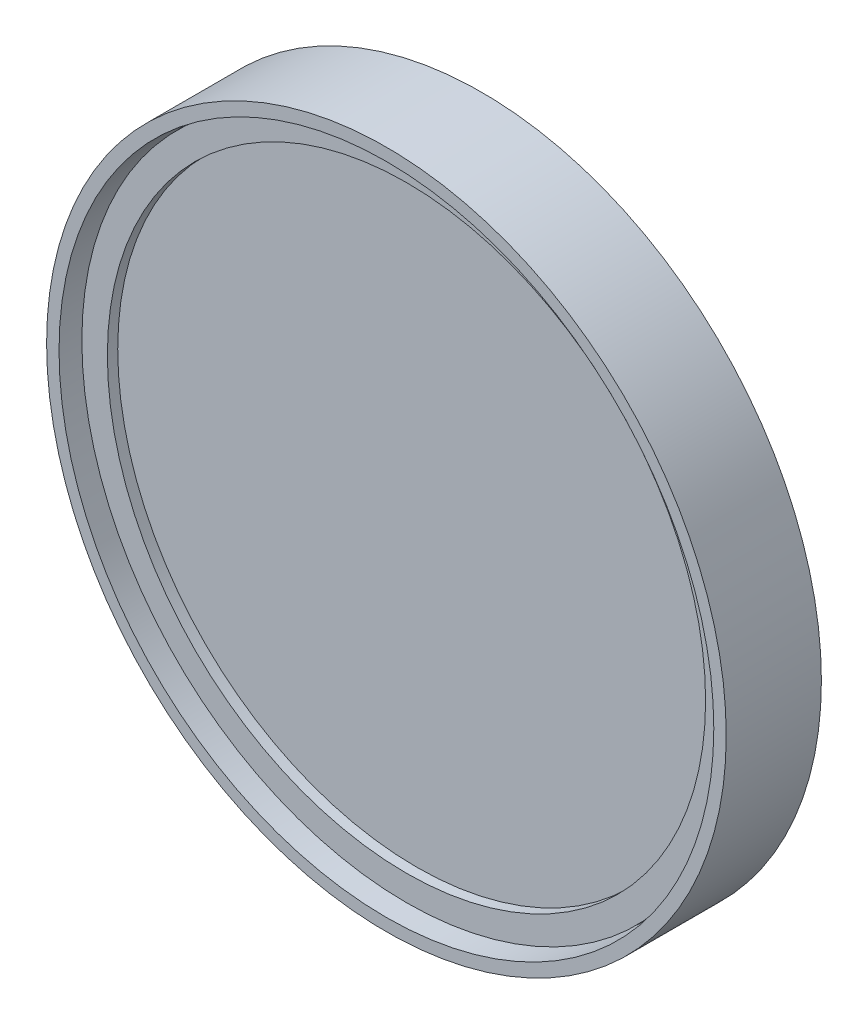
ISO-10303-21;
HEADER;
FILE_DESCRIPTION(('STEP AP214'),'2;1');
FILE_NAME('part.step','',(''),(''),'','','');
FILE_SCHEMA(('AUTOMOTIVE_DESIGN { 1 0 10303 214 1 1 1 1 }'));
ENDSEC;
DATA;
#1=APPLICATION_CONTEXT('core data for automotive mechanical design processes');
#2=APPLICATION_PROTOCOL_DEFINITION('international standard','automotive_design',2000,#1);
#3=PRODUCT_CONTEXT('',#1,'mechanical');
#4=PRODUCT('Part','Part','',(#3));
#5=PRODUCT_RELATED_PRODUCT_CATEGORY('part','',(#4));
#6=PRODUCT_DEFINITION_FORMATION('','',#4);
#7=PRODUCT_DEFINITION_CONTEXT('part definition',#1,'design');
#8=PRODUCT_DEFINITION('design','',#6,#7);
#9=PRODUCT_DEFINITION_SHAPE('','',#8);
#10=(LENGTH_UNIT() NAMED_UNIT(*) SI_UNIT(.MILLI.,.METRE.));
#11=(NAMED_UNIT(*) PLANE_ANGLE_UNIT() SI_UNIT($,.RADIAN.));
#12=(NAMED_UNIT(*) SI_UNIT($,.STERADIAN.) SOLID_ANGLE_UNIT());
#13=UNCERTAINTY_MEASURE_WITH_UNIT(LENGTH_MEASURE(1.E-05),#10,'distance_accuracy_value','');
#14=(GEOMETRIC_REPRESENTATION_CONTEXT(3) GLOBAL_UNCERTAINTY_ASSIGNED_CONTEXT((#13)) GLOBAL_UNIT_ASSIGNED_CONTEXT((#10,
#11,#12)) REPRESENTATION_CONTEXT('',''));
#15=CARTESIAN_POINT('',(0.,0.,0.));
#16=DIRECTION('',(0.,0.,1.));
#17=DIRECTION('',(1.,0.,0.));
#18=AXIS2_PLACEMENT_3D('',#15,#16,#17);
#19=CARTESIAN_POINT('',(0.,0.,2.762));
#20=DIRECTION('',(0.,0.,1.));
#21=DIRECTION('',(1.,0.,0.));
#22=AXIS2_PLACEMENT_3D('',#19,#20,#21);
#23=PLANE('',#22);
#24=CARTESIAN_POINT('',(0.,0.,2.762));
#25=DIRECTION('',(0.,0.,1.));
#26=DIRECTION('',(1.,0.,0.));
#27=AXIS2_PLACEMENT_3D('',#24,#25,#26);
#28=CIRCLE('',#27,11.);
#29=CARTESIAN_POINT('',(11.,0.,2.762));
#30=VERTEX_POINT('',#29);
#31=EDGE_CURVE('P0_E46',#30,#30,#28,.T.);
#32=ORIENTED_EDGE('',*,*,#31,.F.);
#33=EDGE_LOOP('',(#32));
#34=FACE_BOUND('',#33,.T.);
#35=CARTESIAN_POINT('',(0.,0.,2.762));
#36=DIRECTION('',(0.,0.,1.));
#37=DIRECTION('',(1.,0.,0.));
#38=AXIS2_PLACEMENT_3D('',#35,#36,#37);
#39=CIRCLE('',#38,11.938);
#40=CARTESIAN_POINT('',(11.938,0.,2.762));
#41=VERTEX_POINT('',#40);
#42=EDGE_CURVE('P0_E35',#41,#41,#39,.F.);
#43=ORIENTED_EDGE('',*,*,#42,.F.);
#44=EDGE_LOOP('',(#43));
#45=FACE_BOUND('',#44,.T.);
#46=ADVANCED_FACE('P0_F32',(#34,#45),#23,.T.);
#47=CARTESIAN_POINT('',(0.,0.,2.381));
#48=DIRECTION('',(0.,0.,1.));
#49=DIRECTION('',(1.,0.,0.));
#50=AXIS2_PLACEMENT_3D('',#47,#48,#49);
#51=CYLINDRICAL_SURFACE('',#50,11.938);
#52=ORIENTED_EDGE('',*,*,#42,.T.);
#53=EDGE_LOOP('',(#52));
#54=FACE_BOUND('',#53,.T.);
#55=CARTESIAN_POINT('',(0.,0.,2.381));
#56=DIRECTION('',(0.,0.,1.));
#57=DIRECTION('',(1.,0.,0.));
#58=AXIS2_PLACEMENT_3D('',#55,#56,#57);
#59=CIRCLE('',#58,11.938);
#60=CARTESIAN_POINT('',(11.938,0.,2.381));
#61=VERTEX_POINT('',#60);
#62=EDGE_CURVE('P0_E10',#61,#61,#59,.T.);
#63=ORIENTED_EDGE('',*,*,#62,.T.);
#64=EDGE_LOOP('',(#63));
#65=FACE_BOUND('',#64,.T.);
#66=ADVANCED_FACE('P0_F54',(#54,#65),#51,.T.);
#67=CARTESIAN_POINT('',(0.,0.,2.381));
#68=DIRECTION('',(0.,0.,1.));
#69=DIRECTION('',(1.,0.,0.));
#70=AXIS2_PLACEMENT_3D('',#67,#68,#69);
#71=PLANE('',#70);
#72=CARTESIAN_POINT('',(0.,0.,2.381));
#73=DIRECTION('',(0.,0.,1.));
#74=DIRECTION('',(1.,0.,0.));
#75=AXIS2_PLACEMENT_3D('',#72,#73,#74);
#76=CIRCLE('',#75,11.);
#77=CARTESIAN_POINT('',(11.,0.,2.381));
#78=VERTEX_POINT('',#77);
#79=EDGE_CURVE('P0_E42',#78,#78,#76,.F.);
#80=ORIENTED_EDGE('',*,*,#79,.F.);
#81=EDGE_LOOP('',(#80));
#82=FACE_BOUND('',#81,.T.);
#83=ORIENTED_EDGE('',*,*,#62,.F.);
#84=EDGE_LOOP('',(#83));
#85=FACE_BOUND('',#84,.T.);
#86=ADVANCED_FACE('P0_F58',(#82,#85),#71,.F.);
#87=CARTESIAN_POINT('',(0.,0.,-28.7316983722081));
#88=DIRECTION('',(0.,0.,1.));
#89=DIRECTION('',(1.,0.,0.));
#90=AXIS2_PLACEMENT_3D('',#87,#88,#89);
#91=CYLINDRICAL_SURFACE('',#90,11.);
#92=ORIENTED_EDGE('',*,*,#79,.T.);
#93=EDGE_LOOP('',(#92));
#94=FACE_BOUND('',#93,.T.);
#95=ORIENTED_EDGE('',*,*,#31,.T.);
#96=EDGE_LOOP('',(#95));
#97=FACE_BOUND('',#96,.T.);
#98=ADVANCED_FACE('P0_F50',(#94,#97),#91,.F.);
#99=CLOSED_SHELL('',(#46,#66,#86,#98));
#100=MANIFOLD_SOLID_BREP('P0_B2',#99);
#101=CARTESIAN_POINT('',(0.,0.,2.381));
#102=DIRECTION('',(0.,0.,1.));
#103=DIRECTION('',(1.,0.,0.));
#104=AXIS2_PLACEMENT_3D('',#101,#102,#103);
#105=PLANE('',#104);
#106=CARTESIAN_POINT('',(0.,0.,2.381));
#107=DIRECTION('',(0.,0.,1.));
#108=DIRECTION('',(1.,0.,0.));
#109=AXIS2_PLACEMENT_3D('',#106,#107,#108);
#110=CIRCLE('',#109,11.95);
#111=CARTESIAN_POINT('',(11.95,0.,2.381));
#112=VERTEX_POINT('',#111);
#113=EDGE_CURVE('P1_E17',#112,#112,#110,.F.);
#114=ORIENTED_EDGE('',*,*,#113,.F.);
#115=EDGE_LOOP('',(#114));
#116=FACE_BOUND('',#115,.T.);
#117=ADVANCED_FACE('P1_F14',(#116),#105,.T.);
#118=CARTESIAN_POINT('',(0.,0.,0.381000000000001));
#119=DIRECTION('',(0.,0.,1.));
#120=DIRECTION('',(1.,0.,0.));
#121=AXIS2_PLACEMENT_3D('',#118,#119,#120);
#122=CYLINDRICAL_SURFACE('',#121,11.95);
#123=ORIENTED_EDGE('',*,*,#113,.T.);
#124=EDGE_LOOP('',(#123));
#125=FACE_BOUND('',#124,.T.);
#126=CARTESIAN_POINT('',(0.,0.,0.381000000000001));
#127=DIRECTION('',(0.,0.,1.));
#128=DIRECTION('',(1.,0.,0.));
#129=AXIS2_PLACEMENT_3D('',#126,#127,#128);
#130=CIRCLE('',#129,11.95);
#131=CARTESIAN_POINT('',(11.95,0.,0.381000000000001));
#132=VERTEX_POINT('',#131);
#133=EDGE_CURVE('P1_E10',#132,#132,#130,.T.);
#134=ORIENTED_EDGE('',*,*,#133,.T.);
#135=EDGE_LOOP('',(#134));
#136=FACE_BOUND('',#135,.T.);
#137=ADVANCED_FACE('P1_F26',(#125,#136),#122,.T.);
#138=CARTESIAN_POINT('',(0.,0.,0.381000000000001));
#139=DIRECTION('',(0.,0.,1.));
#140=DIRECTION('',(1.,0.,0.));
#141=AXIS2_PLACEMENT_3D('',#138,#139,#140);
#142=PLANE('',#141);
#143=ORIENTED_EDGE('',*,*,#133,.F.);
#144=EDGE_LOOP('',(#143));
#145=FACE_BOUND('',#144,.T.);
#146=ADVANCED_FACE('P1_F33',(#145),#142,.F.);
#147=CLOSED_SHELL('',(#117,#137,#146));
#148=MANIFOLD_SOLID_BREP('P1_B1',#147);
#149=CARTESIAN_POINT('',(0.,0.,0.));
#150=DIRECTION('',(0.,0.,1.));
#151=DIRECTION('',(1.,0.,0.));
#152=AXIS2_PLACEMENT_3D('',#149,#150,#151);
#153=CYLINDRICAL_SURFACE('',#152,12.1031);
#154=CARTESIAN_POINT('',(0.,0.,0.6858));
#155=DIRECTION('',(0.,0.,1.));
#156=DIRECTION('',(1.,0.,0.));
#157=AXIS2_PLACEMENT_3D('',#154,#155,#156);
#158=CIRCLE('',#157,12.1031);
#159=CARTESIAN_POINT('',(12.1031,0.,0.6858));
#160=VERTEX_POINT('',#159);
#161=EDGE_CURVE('P2_E17',#160,#160,#158,.F.);
#162=ORIENTED_EDGE('',*,*,#161,.F.);
#163=EDGE_LOOP('',(#162));
#164=FACE_BOUND('',#163,.T.);
#165=CARTESIAN_POINT('',(0.,0.,0.381));
#166=DIRECTION('',(0.,0.,1.));
#167=DIRECTION('',(1.,0.,0.));
#168=AXIS2_PLACEMENT_3D('',#165,#166,#167);
#169=CIRCLE('',#168,12.1031);
#170=CARTESIAN_POINT('',(12.1031,0.,0.381));
#171=VERTEX_POINT('',#170);
#172=EDGE_CURVE('P2_E39',#171,#171,#169,.T.);
#173=ORIENTED_EDGE('',*,*,#172,.F.);
#174=EDGE_LOOP('',(#173));
#175=FACE_BOUND('',#174,.T.);
#176=ADVANCED_FACE('P2_F14',(#164,#175),#153,.F.);
#177=CARTESIAN_POINT('',(0.,12.0396,0.6858));
#178=DIRECTION('',(0.,0.,-1.));
#179=DIRECTION('',(-1.,0.,0.));
#180=AXIS2_PLACEMENT_3D('',#177,#178,#179);
#181=PLANE('',#180);
#182=ORIENTED_EDGE('',*,*,#161,.T.);
#183=EDGE_LOOP('',(#182));
#184=FACE_BOUND('',#183,.T.);
#185=CARTESIAN_POINT('',(0.,0.,0.6858));
#186=DIRECTION('',(0.,0.,-1.));
#187=DIRECTION('',(-1.,0.,0.));
#188=AXIS2_PLACEMENT_3D('',#185,#186,#187);
#189=CIRCLE('',#188,12.0396);
#190=CARTESIAN_POINT('',(-12.0396,0.,0.6858));
#191=VERTEX_POINT('',#190);
#192=EDGE_CURVE('P2_E37',#191,#191,#189,.F.);
#193=ORIENTED_EDGE('',*,*,#192,.T.);
#194=EDGE_LOOP('',(#193));
#195=FACE_BOUND('',#194,.T.);
#196=ADVANCED_FACE('P2_F46',(#184,#195),#181,.T.);
#197=CARTESIAN_POINT('',(0.,10.6045,0.381));
#198=DIRECTION('',(0.,0.,1.));
#199=DIRECTION('',(1.,0.,0.));
#200=AXIS2_PLACEMENT_3D('',#197,#198,#199);
#201=PLANE('',#200);
#202=ORIENTED_EDGE('',*,*,#172,.T.);
#203=EDGE_LOOP('',(#202));
#204=FACE_BOUND('',#203,.T.);
#205=CARTESIAN_POINT('',(0.,0.,0.381));
#206=DIRECTION('',(0.,0.,-1.));
#207=DIRECTION('',(-1.,0.,0.));
#208=AXIS2_PLACEMENT_3D('',#205,#206,#207);
#209=CIRCLE('',#208,10.6045);
#210=CARTESIAN_POINT('',(-10.6045,0.,0.381));
#211=VERTEX_POINT('',#210);
#212=EDGE_CURVE('P2_E34',#211,#211,#209,.T.);
#213=ORIENTED_EDGE('',*,*,#212,.T.);
#214=EDGE_LOOP('',(#213));
#215=FACE_BOUND('',#214,.T.);
#216=ADVANCED_FACE('P2_F55',(#204,#215),#201,.T.);
#217=CARTESIAN_POINT('',(0.,0.,0.));
#218=DIRECTION('',(0.,0.,-1.));
#219=DIRECTION('',(-1.,0.,0.));
#220=AXIS2_PLACEMENT_3D('',#217,#218,#219);
#221=CYLINDRICAL_SURFACE('',#220,12.0396);
#222=ORIENTED_EDGE('',*,*,#192,.F.);
#223=EDGE_LOOP('',(#222));
#224=FACE_BOUND('',#223,.T.);
#225=CARTESIAN_POINT('',(0.,0.,3.5));
#226=DIRECTION('',(0.,0.,-1.));
#227=DIRECTION('',(-1.,0.,0.));
#228=AXIS2_PLACEMENT_3D('',#225,#226,#227);
#229=CIRCLE('',#228,12.0396);
#230=CARTESIAN_POINT('',(-12.0396,0.,3.5));
#231=VERTEX_POINT('',#230);
#232=EDGE_CURVE('P2_E31',#231,#231,#229,.T.);
#233=ORIENTED_EDGE('',*,*,#232,.F.);
#234=EDGE_LOOP('',(#233));
#235=FACE_BOUND('',#234,.T.);
#236=ADVANCED_FACE('P2_F74',(#224,#235),#221,.F.);
#237=CARTESIAN_POINT('',(0.,0.,0.));
#238=DIRECTION('',(0.,0.,-1.));
#239=DIRECTION('',(-1.,0.,0.));
#240=AXIS2_PLACEMENT_3D('',#237,#238,#239);
#241=CYLINDRICAL_SURFACE('',#240,10.6045);
#242=CARTESIAN_POINT('',(0.,0.,0.));
#243=DIRECTION('',(0.,0.,-1.));
#244=DIRECTION('',(-1.,0.,0.));
#245=AXIS2_PLACEMENT_3D('',#242,#243,#244);
#246=CIRCLE('',#245,10.6045);
#247=CARTESIAN_POINT('',(-10.6045,0.,0.));
#248=VERTEX_POINT('',#247);
#249=EDGE_CURVE('P2_E26',#248,#248,#246,.F.);
#250=ORIENTED_EDGE('',*,*,#249,.F.);
#251=EDGE_LOOP('',(#250));
#252=FACE_BOUND('',#251,.T.);
#253=ORIENTED_EDGE('',*,*,#212,.F.);
#254=EDGE_LOOP('',(#253));
#255=FACE_BOUND('',#254,.T.);
#256=ADVANCED_FACE('P2_F70',(#252,#255),#241,.F.);
#257=CARTESIAN_POINT('',(0.,12.0396,3.5));
#258=DIRECTION('',(0.,0.,1.));
#259=DIRECTION('',(1.,0.,0.));
#260=AXIS2_PLACEMENT_3D('',#257,#258,#259);
#261=PLANE('',#260);
#262=CARTESIAN_POINT('',(0.,0.,3.5));
#263=DIRECTION('',(0.,0.,-1.));
#264=DIRECTION('',(-1.,0.,0.));
#265=AXIS2_PLACEMENT_3D('',#262,#263,#264);
#266=CIRCLE('',#265,12.4968);
#267=CARTESIAN_POINT('',(-12.4968,0.,3.5));
#268=VERTEX_POINT('',#267);
#269=EDGE_CURVE('P2_E21',#268,#268,#266,.T.);
#270=ORIENTED_EDGE('',*,*,#269,.F.);
#271=EDGE_LOOP('',(#270));
#272=FACE_BOUND('',#271,.T.);
#273=ORIENTED_EDGE('',*,*,#232,.T.);
#274=EDGE_LOOP('',(#273));
#275=FACE_BOUND('',#274,.T.);
#276=ADVANCED_FACE('P2_F63',(#272,#275),#261,.T.);
#277=CARTESIAN_POINT('',(0.,10.6045,0.));
#278=DIRECTION('',(0.,0.,-1.));
#279=DIRECTION('',(-1.,0.,0.));
#280=AXIS2_PLACEMENT_3D('',#277,#278,#279);
#281=PLANE('',#280);
#282=ORIENTED_EDGE('',*,*,#249,.T.);
#283=EDGE_LOOP('',(#282));
#284=FACE_BOUND('',#283,.T.);
#285=CARTESIAN_POINT('',(0.,0.,0.));
#286=DIRECTION('',(0.,0.,-1.));
#287=DIRECTION('',(-1.,0.,0.));
#288=AXIS2_PLACEMENT_3D('',#285,#286,#287);
#289=CIRCLE('',#288,12.4968);
#290=CARTESIAN_POINT('',(-12.4968,0.,0.));
#291=VERTEX_POINT('',#290);
#292=EDGE_CURVE('P2_E10',#291,#291,#289,.F.);
#293=ORIENTED_EDGE('',*,*,#292,.F.);
#294=EDGE_LOOP('',(#293));
#295=FACE_BOUND('',#294,.T.);
#296=ADVANCED_FACE('P2_F58',(#284,#295),#281,.T.);
#297=CARTESIAN_POINT('',(0.,0.,0.));
#298=DIRECTION('',(0.,0.,-1.));
#299=DIRECTION('',(-1.,0.,0.));
#300=AXIS2_PLACEMENT_3D('',#297,#298,#299);
#301=CYLINDRICAL_SURFACE('',#300,12.4968);
#302=ORIENTED_EDGE('',*,*,#292,.T.);
#303=EDGE_LOOP('',(#302));
#304=FACE_BOUND('',#303,.T.);
#305=ORIENTED_EDGE('',*,*,#269,.T.);
#306=EDGE_LOOP('',(#305));
#307=FACE_BOUND('',#306,.T.);
#308=ADVANCED_FACE('P2_F56',(#304,#307),#301,.T.);
#309=CLOSED_SHELL('',(#176,#196,#216,#236,#256,#276,#296,#308));
#310=MANIFOLD_SOLID_BREP('P2_B1',#309);
#311=ADVANCED_BREP_SHAPE_REPRESENTATION('',(#18,#100,#148,#310),#14);
#312=SHAPE_DEFINITION_REPRESENTATION(#9,#311);
ENDSEC;
END-ISO-10303-21;
